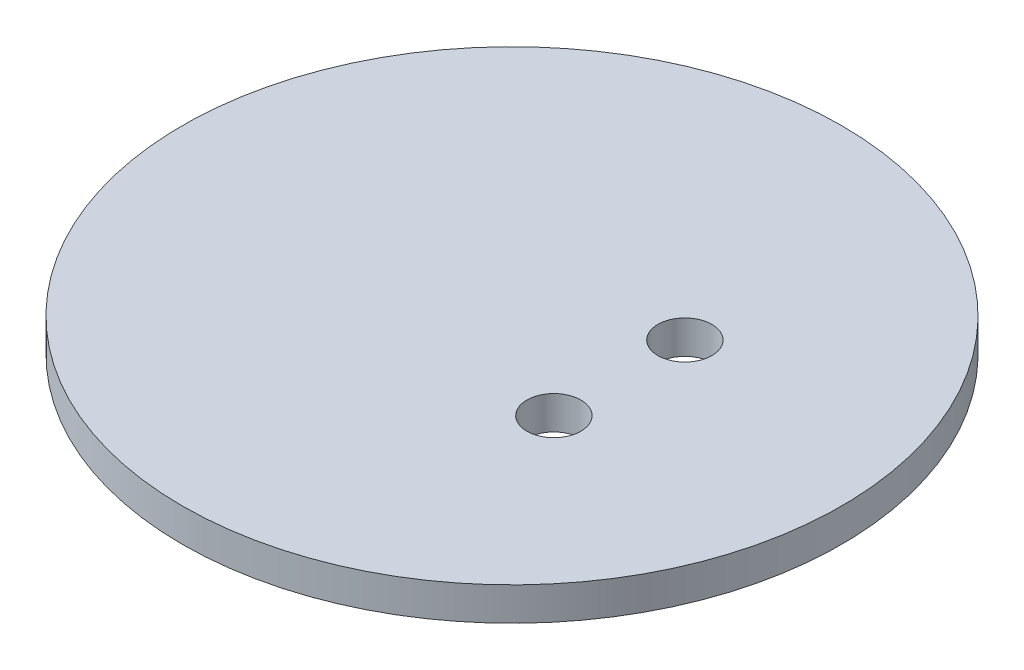
ISO-10303-21;
HEADER;
FILE_DESCRIPTION(('STEP AP214'),'2;1');
FILE_NAME('part.step','',(''),(''),'','','');
FILE_SCHEMA(('AUTOMOTIVE_DESIGN { 1 0 10303 214 1 1 1 1 }'));
ENDSEC;
DATA;
#1=APPLICATION_CONTEXT('core data for automotive mechanical design processes');
#2=APPLICATION_PROTOCOL_DEFINITION('international standard','automotive_design',2000,#1);
#3=PRODUCT_CONTEXT('',#1,'mechanical');
#4=PRODUCT('Part','Part','',(#3));
#5=PRODUCT_RELATED_PRODUCT_CATEGORY('part','',(#4));
#6=PRODUCT_DEFINITION_FORMATION('','',#4);
#7=PRODUCT_DEFINITION_CONTEXT('part definition',#1,'design');
#8=PRODUCT_DEFINITION('design','',#6,#7);
#9=PRODUCT_DEFINITION_SHAPE('','',#8);
#10=(LENGTH_UNIT() NAMED_UNIT(*) SI_UNIT(.MILLI.,.METRE.));
#11=(NAMED_UNIT(*) PLANE_ANGLE_UNIT() SI_UNIT($,.RADIAN.));
#12=(NAMED_UNIT(*) SI_UNIT($,.STERADIAN.) SOLID_ANGLE_UNIT());
#13=UNCERTAINTY_MEASURE_WITH_UNIT(LENGTH_MEASURE(1.E-05),#10,'distance_accuracy_value','');
#14=(GEOMETRIC_REPRESENTATION_CONTEXT(3) GLOBAL_UNCERTAINTY_ASSIGNED_CONTEXT((#13)) GLOBAL_UNIT_ASSIGNED_CONTEXT((#10,
#11,#12)) REPRESENTATION_CONTEXT('',''));
#15=CARTESIAN_POINT('',(0.,0.,0.));
#16=DIRECTION('',(0.,0.,1.));
#17=DIRECTION('',(1.,0.,0.));
#18=AXIS2_PLACEMENT_3D('',#15,#16,#17);
#19=CARTESIAN_POINT('',(0.,0.8,0.));
#20=DIRECTION('',(0.,-1.,0.));
#21=DIRECTION('',(0.,0.,-1.));
#22=AXIS2_PLACEMENT_3D('',#19,#20,#21);
#23=CYLINDRICAL_SURFACE('',#22,7.925);
#24=CARTESIAN_POINT('',(0.,0.8,0.));
#25=DIRECTION('',(0.,1.,0.));
#26=DIRECTION('',(0.,0.,1.));
#27=AXIS2_PLACEMENT_3D('',#24,#25,#26);
#28=CIRCLE('',#27,7.925);
#29=CARTESIAN_POINT('',(0.,0.8,7.925));
#30=VERTEX_POINT('',#29);
#31=EDGE_CURVE('E10',#30,#30,#28,.T.);
#32=ORIENTED_EDGE('',*,*,#31,.F.);
#33=EDGE_LOOP('',(#32));
#34=FACE_BOUND('',#33,.T.);
#35=CARTESIAN_POINT('',(0.,0.,0.));
#36=DIRECTION('',(0.,1.,0.));
#37=DIRECTION('',(0.,0.,1.));
#38=AXIS2_PLACEMENT_3D('',#35,#36,#37);
#39=CIRCLE('',#38,7.925);
#40=CARTESIAN_POINT('',(0.,0.,7.925));
#41=VERTEX_POINT('',#40);
#42=EDGE_CURVE('E41',#41,#41,#39,.T.);
#43=ORIENTED_EDGE('',*,*,#42,.T.);
#44=EDGE_LOOP('',(#43));
#45=FACE_BOUND('',#44,.T.);
#46=ADVANCED_FACE('F34',(#34,#45),#23,.T.);
#47=CARTESIAN_POINT('',(0.,0.8,0.));
#48=DIRECTION('',(0.,1.,0.));
#49=DIRECTION('',(0.,0.,1.));
#50=AXIS2_PLACEMENT_3D('',#47,#48,#49);
#51=PLANE('',#50);
#52=CARTESIAN_POINT('',(2.58263431402899,0.8,-1.575));
#53=DIRECTION('',(0.,1.,0.));
#54=DIRECTION('',(0.,0.,1.));
#55=AXIS2_PLACEMENT_3D('',#52,#53,#54);
#56=CIRCLE('',#55,0.65);
#57=CARTESIAN_POINT('',(2.58263431402899,0.8,-0.925));
#58=VERTEX_POINT('',#57);
#59=EDGE_CURVE('E52',#58,#58,#56,.T.);
#60=ORIENTED_EDGE('',*,*,#59,.F.);
#61=EDGE_LOOP('',(#60));
#62=FACE_BOUND('',#61,.T.);
#63=CARTESIAN_POINT('',(2.58263431402899,0.8,1.575));
#64=DIRECTION('',(0.,1.,0.));
#65=DIRECTION('',(0.,0.,1.));
#66=AXIS2_PLACEMENT_3D('',#63,#64,#65);
#67=CIRCLE('',#66,0.65);
#68=CARTESIAN_POINT('',(2.58263431402899,0.8,2.225));
#69=VERTEX_POINT('',#68);
#70=EDGE_CURVE('E48',#69,#69,#67,.T.);
#71=ORIENTED_EDGE('',*,*,#70,.F.);
#72=EDGE_LOOP('',(#71));
#73=FACE_BOUND('',#72,.T.);
#74=ORIENTED_EDGE('',*,*,#31,.T.);
#75=EDGE_LOOP('',(#74));
#76=FACE_BOUND('',#75,.T.);
#77=ADVANCED_FACE('F65',(#62,#73,#76),#51,.T.);
#78=CARTESIAN_POINT('',(0.,0.,0.));
#79=DIRECTION('',(0.,1.,0.));
#80=DIRECTION('',(0.,0.,1.));
#81=AXIS2_PLACEMENT_3D('',#78,#79,#80);
#82=PLANE('',#81);
#83=CARTESIAN_POINT('',(2.58263431402899,0.,-1.575));
#84=DIRECTION('',(0.,1.,0.));
#85=DIRECTION('',(0.,0.,1.));
#86=AXIS2_PLACEMENT_3D('',#83,#84,#85);
#87=CIRCLE('',#86,0.65);
#88=CARTESIAN_POINT('',(2.58263431402899,0.,-0.925));
#89=VERTEX_POINT('',#88);
#90=EDGE_CURVE('E37',#89,#89,#87,.T.);
#91=ORIENTED_EDGE('',*,*,#90,.T.);
#92=EDGE_LOOP('',(#91));
#93=FACE_BOUND('',#92,.T.);
#94=CARTESIAN_POINT('',(2.58263431402899,0.,1.575));
#95=DIRECTION('',(0.,1.,0.));
#96=DIRECTION('',(0.,0.,1.));
#97=AXIS2_PLACEMENT_3D('',#94,#95,#96);
#98=CIRCLE('',#97,0.65);
#99=CARTESIAN_POINT('',(2.58263431402899,0.,2.225));
#100=VERTEX_POINT('',#99);
#101=EDGE_CURVE('E50',#100,#100,#98,.T.);
#102=ORIENTED_EDGE('',*,*,#101,.T.);
#103=EDGE_LOOP('',(#102));
#104=FACE_BOUND('',#103,.T.);
#105=ORIENTED_EDGE('',*,*,#42,.F.);
#106=EDGE_LOOP('',(#105));
#107=FACE_BOUND('',#106,.T.);
#108=ADVANCED_FACE('F67',(#93,#104,#107),#82,.F.);
#109=CARTESIAN_POINT('',(2.58263431402899,-0.0999999999999999,1.575));
#110=DIRECTION('',(0.,1.,0.));
#111=DIRECTION('',(0.,0.,1.));
#112=AXIS2_PLACEMENT_3D('',#109,#110,#111);
#113=CYLINDRICAL_SURFACE('',#112,0.65);
#114=ORIENTED_EDGE('',*,*,#70,.T.);
#115=EDGE_LOOP('',(#114));
#116=FACE_BOUND('',#115,.T.);
#117=ORIENTED_EDGE('',*,*,#101,.F.);
#118=EDGE_LOOP('',(#117));
#119=FACE_BOUND('',#118,.T.);
#120=ADVANCED_FACE('F62',(#116,#119),#113,.F.);
#121=CARTESIAN_POINT('',(2.58263431402899,-0.0999999999999999,-1.575));
#122=DIRECTION('',(0.,1.,0.));
#123=DIRECTION('',(0.,0.,1.));
#124=AXIS2_PLACEMENT_3D('',#121,#122,#123);
#125=CYLINDRICAL_SURFACE('',#124,0.65);
#126=ORIENTED_EDGE('',*,*,#59,.T.);
#127=EDGE_LOOP('',(#126));
#128=FACE_BOUND('',#127,.T.);
#129=ORIENTED_EDGE('',*,*,#90,.F.);
#130=EDGE_LOOP('',(#129));
#131=FACE_BOUND('',#130,.T.);
#132=ADVANCED_FACE('F79',(#128,#131),#125,.F.);
#133=CLOSED_SHELL('',(#46,#77,#108,#120,#132));
#134=MANIFOLD_SOLID_BREP('B2',#133);
#135=ADVANCED_BREP_SHAPE_REPRESENTATION('',(#18,#134),#14);
#136=SHAPE_DEFINITION_REPRESENTATION(#9,#135);
ENDSEC;
END-ISO-10303-21;
